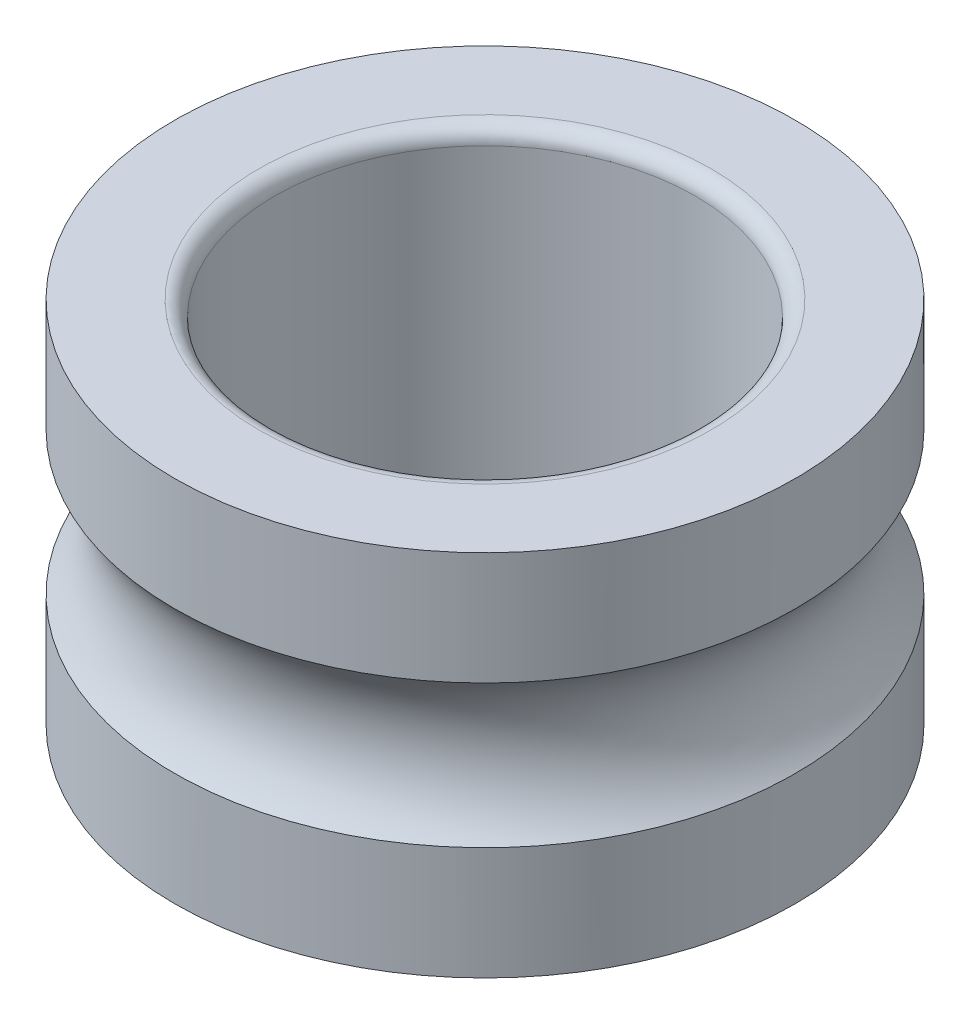
ISO-10303-21;
HEADER;
FILE_DESCRIPTION(('STEP AP214'),'2;1');
FILE_NAME('part.step','',(''),(''),'','','');
FILE_SCHEMA(('AUTOMOTIVE_DESIGN { 1 0 10303 214 1 1 1 1 }'));
ENDSEC;
DATA;
#1=APPLICATION_CONTEXT('core data for automotive mechanical design processes');
#2=APPLICATION_PROTOCOL_DEFINITION('international standard','automotive_design',2000,#1);
#3=PRODUCT_CONTEXT('',#1,'mechanical');
#4=PRODUCT('Part','Part','',(#3));
#5=PRODUCT_RELATED_PRODUCT_CATEGORY('part','',(#4));
#6=PRODUCT_DEFINITION_FORMATION('','',#4);
#7=PRODUCT_DEFINITION_CONTEXT('part definition',#1,'design');
#8=PRODUCT_DEFINITION('design','',#6,#7);
#9=PRODUCT_DEFINITION_SHAPE('','',#8);
#10=(LENGTH_UNIT() NAMED_UNIT(*) SI_UNIT(.MILLI.,.METRE.));
#11=(NAMED_UNIT(*) PLANE_ANGLE_UNIT() SI_UNIT($,.RADIAN.));
#12=(NAMED_UNIT(*) SI_UNIT($,.STERADIAN.) SOLID_ANGLE_UNIT());
#13=UNCERTAINTY_MEASURE_WITH_UNIT(LENGTH_MEASURE(1.E-05),#10,'distance_accuracy_value','');
#14=(GEOMETRIC_REPRESENTATION_CONTEXT(3) GLOBAL_UNCERTAINTY_ASSIGNED_CONTEXT((#13)) GLOBAL_UNIT_ASSIGNED_CONTEXT((#10,
#11,#12)) REPRESENTATION_CONTEXT('',''));
#15=CARTESIAN_POINT('',(0.,0.,0.));
#16=DIRECTION('',(0.,0.,1.));
#17=DIRECTION('',(1.,0.,0.));
#18=AXIS2_PLACEMENT_3D('',#15,#16,#17);
#19=CARTESIAN_POINT('',(0.,-3.5,0.));
#20=DIRECTION('',(0.,1.,0.));
#21=DIRECTION('',(1.,0.,0.));
#22=AXIS2_PLACEMENT_3D('',#19,#20,#21);
#23=PLANE('',#22);
#24=CARTESIAN_POINT('',(0.,-3.5,0.));
#25=DIRECTION('',(0.,-1.,0.));
#26=DIRECTION('',(0.,0.,1.));
#27=AXIS2_PLACEMENT_3D('',#24,#25,#26);
#28=CIRCLE('',#27,4.3);
#29=CARTESIAN_POINT('',(0.,-3.5,-4.3));
#30=VERTEX_POINT('',#29);
#31=EDGE_CURVE('E21',#30,#30,#28,.T.);
#32=ORIENTED_EDGE('',*,*,#31,.F.);
#33=EDGE_LOOP('',(#32));
#34=FACE_BOUND('',#33,.T.);
#35=CARTESIAN_POINT('',(0.,-3.5,0.));
#36=DIRECTION('',(0.,1.,0.));
#37=DIRECTION('',(0.,0.,1.));
#38=AXIS2_PLACEMENT_3D('',#35,#36,#37);
#39=CIRCLE('',#38,5.9);
#40=CARTESIAN_POINT('',(0.,-3.5,5.9));
#41=VERTEX_POINT('',#40);
#42=EDGE_CURVE('E11',#41,#41,#39,.T.);
#43=ORIENTED_EDGE('',*,*,#42,.F.);
#44=EDGE_LOOP('',(#43));
#45=FACE_BOUND('',#44,.T.);
#46=ADVANCED_FACE('F17',(#34,#45),#23,.F.);
#47=CARTESIAN_POINT('',(0.,-3.85,0.));
#48=DIRECTION('',(0.,1.,0.));
#49=DIRECTION('',(0.,0.,-1.));
#50=AXIS2_PLACEMENT_3D('',#47,#48,#49);
#51=CYLINDRICAL_SURFACE('',#50,5.9);
#52=CARTESIAN_POINT('',(0.,-1.355429821127,0.));
#53=DIRECTION('',(0.,-1.,0.));
#54=DIRECTION('',(0.,0.,-1.));
#55=AXIS2_PLACEMENT_3D('',#52,#53,#54);
#56=CIRCLE('',#55,5.9);
#57=CARTESIAN_POINT('',(0.,-1.355429821127,-5.9));
#58=VERTEX_POINT('',#57);
#59=EDGE_CURVE('E28',#58,#58,#56,.T.);
#60=ORIENTED_EDGE('',*,*,#59,.T.);
#61=EDGE_LOOP('',(#60));
#62=FACE_BOUND('',#61,.T.);
#63=ORIENTED_EDGE('',*,*,#42,.T.);
#64=EDGE_LOOP('',(#63));
#65=FACE_BOUND('',#64,.T.);
#66=ADVANCED_FACE('F105',(#62,#65),#51,.T.);
#67=CARTESIAN_POINT('',(0.,0.,0.));
#68=DIRECTION('',(0.,1.,0.));
#69=DIRECTION('',(0.,0.,-1.));
#70=AXIS2_PLACEMENT_3D('',#67,#68,#69);
#71=TOROIDAL_SURFACE('',#70,7.3495,1.9845);
#72=ORIENTED_EDGE('',*,*,#59,.F.);
#73=EDGE_LOOP('',(#72));
#74=FACE_BOUND('',#73,.T.);
#75=CARTESIAN_POINT('',(0.,1.355429821127,0.));
#76=DIRECTION('',(0.,1.,0.));
#77=DIRECTION('',(0.,0.,1.));
#78=AXIS2_PLACEMENT_3D('',#75,#76,#77);
#79=CIRCLE('',#78,5.9);
#80=CARTESIAN_POINT('',(0.,1.355429821127,5.9));
#81=VERTEX_POINT('',#80);
#82=EDGE_CURVE('E75',#81,#81,#79,.T.);
#83=ORIENTED_EDGE('',*,*,#82,.F.);
#84=EDGE_LOOP('',(#83));
#85=FACE_BOUND('',#84,.T.);
#86=ADVANCED_FACE('F19',(#74,#85),#71,.F.);
#87=CARTESIAN_POINT('',(0.,-3.85,0.));
#88=DIRECTION('',(0.,1.,0.));
#89=DIRECTION('',(0.,0.,-1.));
#90=AXIS2_PLACEMENT_3D('',#87,#88,#89);
#91=CYLINDRICAL_SURFACE('',#90,5.9);
#92=CARTESIAN_POINT('',(0.,3.5,0.));
#93=DIRECTION('',(0.,-1.,0.));
#94=DIRECTION('',(0.,0.,1.));
#95=AXIS2_PLACEMENT_3D('',#92,#93,#94);
#96=CIRCLE('',#95,5.9);
#97=CARTESIAN_POINT('',(0.,3.5,5.9));
#98=VERTEX_POINT('',#97);
#99=EDGE_CURVE('E70',#98,#98,#96,.T.);
#100=ORIENTED_EDGE('',*,*,#99,.T.);
#101=EDGE_LOOP('',(#100));
#102=FACE_BOUND('',#101,.T.);
#103=ORIENTED_EDGE('',*,*,#82,.T.);
#104=EDGE_LOOP('',(#103));
#105=FACE_BOUND('',#104,.T.);
#106=ADVANCED_FACE('F71',(#102,#105),#91,.T.);
#107=CARTESIAN_POINT('',(0.,3.5,0.));
#108=DIRECTION('',(0.,1.,0.));
#109=DIRECTION('',(1.,0.,0.));
#110=AXIS2_PLACEMENT_3D('',#107,#108,#109);
#111=PLANE('',#110);
#112=CARTESIAN_POINT('',(0.,3.5,0.));
#113=DIRECTION('',(0.,1.,0.));
#114=DIRECTION('',(0.,0.,1.));
#115=AXIS2_PLACEMENT_3D('',#112,#113,#114);
#116=CIRCLE('',#115,4.3);
#117=CARTESIAN_POINT('',(0.,3.5,4.3));
#118=VERTEX_POINT('',#117);
#119=EDGE_CURVE('E63',#118,#118,#116,.T.);
#120=ORIENTED_EDGE('',*,*,#119,.F.);
#121=EDGE_LOOP('',(#120));
#122=FACE_BOUND('',#121,.T.);
#123=ORIENTED_EDGE('',*,*,#99,.F.);
#124=EDGE_LOOP('',(#123));
#125=FACE_BOUND('',#124,.T.);
#126=ADVANCED_FACE('F118',(#122,#125),#111,.T.);
#127=CARTESIAN_POINT('',(0.,3.2,0.));
#128=DIRECTION('',(0.,1.,0.));
#129=DIRECTION('',(0.,0.,-1.));
#130=AXIS2_PLACEMENT_3D('',#127,#128,#129);
#131=TOROIDAL_SURFACE('',#130,4.3,0.3);
#132=CARTESIAN_POINT('',(0.,3.2,0.));
#133=DIRECTION('',(0.,1.,0.));
#134=DIRECTION('',(0.,0.,1.));
#135=AXIS2_PLACEMENT_3D('',#132,#133,#134);
#136=CIRCLE('',#135,4.);
#137=CARTESIAN_POINT('',(0.,3.2,-4.));
#138=VERTEX_POINT('',#137);
#139=EDGE_CURVE('E83',#138,#138,#136,.T.);
#140=ORIENTED_EDGE('',*,*,#139,.F.);
#141=EDGE_LOOP('',(#140));
#142=FACE_BOUND('',#141,.T.);
#143=ORIENTED_EDGE('',*,*,#119,.T.);
#144=EDGE_LOOP('',(#143));
#145=FACE_BOUND('',#144,.T.);
#146=ADVANCED_FACE('F115',(#142,#145),#131,.T.);
#147=CARTESIAN_POINT('',(0.,-3.85,0.));
#148=DIRECTION('',(0.,1.,0.));
#149=DIRECTION('',(0.,0.,-1.));
#150=AXIS2_PLACEMENT_3D('',#147,#148,#149);
#151=CYLINDRICAL_SURFACE('',#150,4.);
#152=ORIENTED_EDGE('',*,*,#139,.T.);
#153=EDGE_LOOP('',(#152));
#154=FACE_BOUND('',#153,.T.);
#155=CARTESIAN_POINT('',(0.,-3.2,0.));
#156=DIRECTION('',(0.,-1.,0.));
#157=DIRECTION('',(0.,0.,1.));
#158=AXIS2_PLACEMENT_3D('',#155,#156,#157);
#159=CIRCLE('',#158,4.);
#160=CARTESIAN_POINT('',(0.,-3.2,-4.));
#161=VERTEX_POINT('',#160);
#162=EDGE_CURVE('E90',#161,#161,#159,.T.);
#163=ORIENTED_EDGE('',*,*,#162,.T.);
#164=EDGE_LOOP('',(#163));
#165=FACE_BOUND('',#164,.T.);
#166=ADVANCED_FACE('F117',(#154,#165),#151,.F.);
#167=CARTESIAN_POINT('',(0.,-3.2,0.));
#168=DIRECTION('',(0.,1.,0.));
#169=DIRECTION('',(0.,0.,-1.));
#170=AXIS2_PLACEMENT_3D('',#167,#168,#169);
#171=TOROIDAL_SURFACE('',#170,4.3,0.3);
#172=ORIENTED_EDGE('',*,*,#31,.T.);
#173=EDGE_LOOP('',(#172));
#174=FACE_BOUND('',#173,.T.);
#175=ORIENTED_EDGE('',*,*,#162,.F.);
#176=EDGE_LOOP('',(#175));
#177=FACE_BOUND('',#176,.T.);
#178=ADVANCED_FACE('F100',(#174,#177),#171,.T.);
#179=CLOSED_SHELL('',(#46,#66,#86,#106,#126,#146,#166,#178));
#180=MANIFOLD_SOLID_BREP('B1',#179);
#181=ADVANCED_BREP_SHAPE_REPRESENTATION('',(#18,#180),#14);
#182=SHAPE_DEFINITION_REPRESENTATION(#9,#181);
ENDSEC;
END-ISO-10303-21;
